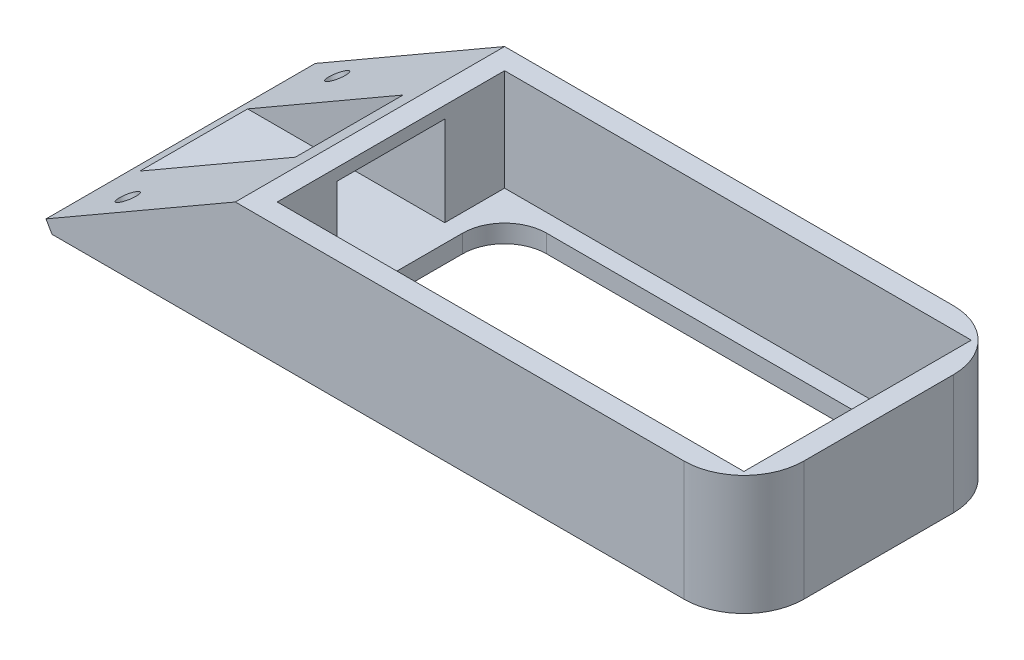
ISO-10303-21;
HEADER;
FILE_DESCRIPTION(('STEP AP214'),'2;1');
FILE_NAME('part.step','',(''),(''),'','','');
FILE_SCHEMA(('AUTOMOTIVE_DESIGN { 1 0 10303 214 1 1 1 1 }'));
ENDSEC;
DATA;
#1=APPLICATION_CONTEXT('core data for automotive mechanical design processes');
#2=APPLICATION_PROTOCOL_DEFINITION('international standard','automotive_design',2000,#1);
#3=PRODUCT_CONTEXT('',#1,'mechanical');
#4=PRODUCT('Part','Part','',(#3));
#5=PRODUCT_RELATED_PRODUCT_CATEGORY('part','',(#4));
#6=PRODUCT_DEFINITION_FORMATION('','',#4);
#7=PRODUCT_DEFINITION_CONTEXT('part definition',#1,'design');
#8=PRODUCT_DEFINITION('design','',#6,#7);
#9=PRODUCT_DEFINITION_SHAPE('','',#8);
#10=(LENGTH_UNIT() NAMED_UNIT(*) SI_UNIT(.MILLI.,.METRE.));
#11=(NAMED_UNIT(*) PLANE_ANGLE_UNIT() SI_UNIT($,.RADIAN.));
#12=(NAMED_UNIT(*) SI_UNIT($,.STERADIAN.) SOLID_ANGLE_UNIT());
#13=UNCERTAINTY_MEASURE_WITH_UNIT(LENGTH_MEASURE(1.E-05),#10,'distance_accuracy_value','');
#14=(GEOMETRIC_REPRESENTATION_CONTEXT(3) GLOBAL_UNCERTAINTY_ASSIGNED_CONTEXT((#13)) GLOBAL_UNIT_ASSIGNED_CONTEXT((#10,
#11,#12)) REPRESENTATION_CONTEXT('',''));
#15=CARTESIAN_POINT('',(0.,0.,0.));
#16=DIRECTION('',(0.,0.,1.));
#17=DIRECTION('',(1.,0.,0.));
#18=AXIS2_PLACEMENT_3D('',#15,#16,#17);
#19=CARTESIAN_POINT('',(0.,0.,45.));
#20=DIRECTION('',(0.,1.,0.));
#21=DIRECTION('',(0.,0.,1.));
#22=AXIS2_PLACEMENT_3D('',#19,#20,#21);
#23=PLANE('',#22);
#24=DIRECTION('',(1.,0.,0.));
#25=VECTOR('',#24,1.);
#26=CARTESIAN_POINT('',(41.1410161513775,0.,6.49999999999998));
#27=LINE('',#26,#25);
#28=CARTESIAN_POINT('',(48.1410161513775,0.,6.49999999999998));
#29=VERTEX_POINT('',#28);
#30=CARTESIAN_POINT('',(106.141016151377,0.,6.49999999999998));
#31=VERTEX_POINT('',#30);
#32=EDGE_CURVE('E251',#29,#31,#27,.T.);
#33=ORIENTED_EDGE('',*,*,#32,.F.);
#34=CARTESIAN_POINT('',(48.1410161513775,0.,13.5));
#35=DIRECTION('',(0.,1.,0.));
#36=DIRECTION('',(0.,0.,1.));
#37=AXIS2_PLACEMENT_3D('',#34,#35,#36);
#38=CIRCLE('',#37,7.);
#39=CARTESIAN_POINT('',(41.1410161513775,0.,13.5));
#40=VERTEX_POINT('',#39);
#41=EDGE_CURVE('E426',#29,#40,#38,.T.);
#42=ORIENTED_EDGE('',*,*,#41,.T.);
#43=DIRECTION('',(0.,0.,-1.));
#44=VECTOR('',#43,1.);
#45=CARTESIAN_POINT('',(41.1410161513775,0.,38.5));
#46=LINE('',#45,#44);
#47=CARTESIAN_POINT('',(41.1410161513775,0.,31.5));
#48=VERTEX_POINT('',#47);
#49=EDGE_CURVE('E255',#48,#40,#46,.T.);
#50=ORIENTED_EDGE('',*,*,#49,.F.);
#51=CARTESIAN_POINT('',(48.1410161513775,0.,31.5));
#52=DIRECTION('',(0.,1.,0.));
#53=DIRECTION('',(0.,0.,1.));
#54=AXIS2_PLACEMENT_3D('',#51,#52,#53);
#55=CIRCLE('',#54,7.);
#56=CARTESIAN_POINT('',(48.1410161513775,0.,38.5));
#57=VERTEX_POINT('',#56);
#58=EDGE_CURVE('E432',#48,#57,#55,.T.);
#59=ORIENTED_EDGE('',*,*,#58,.T.);
#60=DIRECTION('',(-1.,0.,0.));
#61=VECTOR('',#60,1.);
#62=CARTESIAN_POINT('',(41.1410161513775,0.,38.5));
#63=LINE('',#62,#61);
#64=CARTESIAN_POINT('',(106.141016151377,0.,38.5));
#65=VERTEX_POINT('',#64);
#66=EDGE_CURVE('E275',#65,#57,#63,.T.);
#67=ORIENTED_EDGE('',*,*,#66,.F.);
#68=CARTESIAN_POINT('',(106.141016151377,0.,31.5));
#69=DIRECTION('',(0.,1.,0.));
#70=DIRECTION('',(0.,0.,1.));
#71=AXIS2_PLACEMENT_3D('',#68,#69,#70);
#72=CIRCLE('',#71,7.);
#73=CARTESIAN_POINT('',(113.141016151377,0.,31.5));
#74=VERTEX_POINT('',#73);
#75=EDGE_CURVE('E12',#65,#74,#72,.T.);
#76=ORIENTED_EDGE('',*,*,#75,.T.);
#77=DIRECTION('',(0.,0.,1.));
#78=VECTOR('',#77,1.);
#79=CARTESIAN_POINT('',(113.141016151377,0.,38.5));
#80=LINE('',#79,#78);
#81=CARTESIAN_POINT('',(113.141016151377,0.,13.5));
#82=VERTEX_POINT('',#81);
#83=EDGE_CURVE('E212',#82,#74,#80,.T.);
#84=ORIENTED_EDGE('',*,*,#83,.F.);
#85=CARTESIAN_POINT('',(106.141016151377,0.,13.5));
#86=DIRECTION('',(0.,1.,0.));
#87=DIRECTION('',(0.,0.,1.));
#88=AXIS2_PLACEMENT_3D('',#85,#86,#87);
#89=CIRCLE('',#88,7.);
#90=EDGE_CURVE('E438',#82,#31,#89,.T.);
#91=ORIENTED_EDGE('',*,*,#90,.T.);
#92=EDGE_LOOP('',(#33,#42,#50,#59,#67,#76,#84,#91));
#93=FACE_BOUND('',#92,.T.);
#94=DIRECTION('',(1.,0.,0.));
#95=VECTOR('',#94,1.);
#96=CARTESIAN_POINT('',(0.,0.,0.));
#97=LINE('',#96,#95);
#98=CARTESIAN_POINT('',(3.99999999999999,0.,0.));
#99=VERTEX_POINT('',#98);
#100=CARTESIAN_POINT('',(109.641016151377,0.,0.));
#101=VERTEX_POINT('',#100);
#102=EDGE_CURVE('E320',#99,#101,#97,.T.);
#103=ORIENTED_EDGE('',*,*,#102,.T.);
#104=CARTESIAN_POINT('',(109.641016151377,0.,10.));
#105=DIRECTION('',(0.,1.,0.));
#106=DIRECTION('',(0.,0.,1.));
#107=AXIS2_PLACEMENT_3D('',#104,#105,#106);
#108=CIRCLE('',#107,10.);
#109=CARTESIAN_POINT('',(119.641016151377,0.,10.));
#110=VERTEX_POINT('',#109);
#111=EDGE_CURVE('E388',#101,#110,#108,.F.);
#112=ORIENTED_EDGE('',*,*,#111,.T.);
#113=DIRECTION('',(0.,0.,-1.));
#114=VECTOR('',#113,1.);
#115=CARTESIAN_POINT('',(119.641016151377,0.,45.));
#116=LINE('',#115,#114);
#117=CARTESIAN_POINT('',(119.641016151377,0.,35.));
#118=VERTEX_POINT('',#117);
#119=EDGE_CURVE('E365',#118,#110,#116,.T.);
#120=ORIENTED_EDGE('',*,*,#119,.F.);
#121=CARTESIAN_POINT('',(109.641016151377,0.,35.));
#122=DIRECTION('',(0.,1.,0.));
#123=DIRECTION('',(0.,0.,1.));
#124=AXIS2_PLACEMENT_3D('',#121,#122,#123);
#125=CIRCLE('',#124,10.);
#126=CARTESIAN_POINT('',(109.641016151377,0.,45.));
#127=VERTEX_POINT('',#126);
#128=EDGE_CURVE('E385',#118,#127,#125,.F.);
#129=ORIENTED_EDGE('',*,*,#128,.T.);
#130=DIRECTION('',(1.,0.,0.));
#131=VECTOR('',#130,1.);
#132=CARTESIAN_POINT('',(0.,0.,45.));
#133=LINE('',#132,#131);
#134=CARTESIAN_POINT('',(3.99999999999999,0.,45.));
#135=VERTEX_POINT('',#134);
#136=EDGE_CURVE('E321',#135,#127,#133,.T.);
#137=ORIENTED_EDGE('',*,*,#136,.F.);
#138=DIRECTION('',(0.,0.,-1.));
#139=VECTOR('',#138,1.);
#140=CARTESIAN_POINT('',(3.99999999999999,0.,45.));
#141=LINE('',#140,#139);
#142=EDGE_CURVE('E338',#135,#99,#141,.T.);
#143=ORIENTED_EDGE('',*,*,#142,.T.);
#144=EDGE_LOOP('',(#103,#112,#120,#129,#137,#143));
#145=FACE_BOUND('',#144,.T.);
#146=ADVANCED_FACE('F49',(#93,#145),#23,.F.);
#147=CARTESIAN_POINT('',(119.641016151377,0.,45.));
#148=DIRECTION('',(-1.,0.,0.));
#149=DIRECTION('',(0.,0.,1.));
#150=AXIS2_PLACEMENT_3D('',#147,#148,#149);
#151=PLANE('',#150);
#152=ORIENTED_EDGE('',*,*,#119,.T.);
#153=DIRECTION('',(0.,1.,0.));
#154=VECTOR('',#153,1.);
#155=CARTESIAN_POINT('',(119.641016151377,0.,10.));
#156=LINE('',#155,#154);
#157=CARTESIAN_POINT('',(119.641016151377,20.,10.));
#158=VERTEX_POINT('',#157);
#159=EDGE_CURVE('E372',#110,#158,#156,.T.);
#160=ORIENTED_EDGE('',*,*,#159,.T.);
#161=DIRECTION('',(0.,0.,-1.));
#162=VECTOR('',#161,1.);
#163=CARTESIAN_POINT('',(119.641016151377,20.,45.));
#164=LINE('',#163,#162);
#165=CARTESIAN_POINT('',(119.641016151377,20.,35.));
#166=VERTEX_POINT('',#165);
#167=EDGE_CURVE('E361',#166,#158,#164,.T.);
#168=ORIENTED_EDGE('',*,*,#167,.F.);
#169=DIRECTION('',(0.,1.,0.));
#170=VECTOR('',#169,1.);
#171=CARTESIAN_POINT('',(119.641016151377,0.,35.));
#172=LINE('',#171,#170);
#173=EDGE_CURVE('E369',#166,#118,#172,.F.);
#174=ORIENTED_EDGE('',*,*,#173,.T.);
#175=EDGE_LOOP('',(#152,#160,#168,#174));
#176=FACE_BOUND('',#175,.T.);
#177=ADVANCED_FACE('F488',(#176),#151,.F.);
#178=CARTESIAN_POINT('',(0.,20.,45.));
#179=DIRECTION('',(0.,1.,0.));
#180=DIRECTION('',(0.,0.,1.));
#181=AXIS2_PLACEMENT_3D('',#178,#179,#180);
#182=PLANE('',#181);
#183=DIRECTION('',(0.,0.,1.));
#184=VECTOR('',#183,1.);
#185=CARTESIAN_POINT('',(38.1410161513774,20.,41.5));
#186=LINE('',#185,#184);
#187=CARTESIAN_POINT('',(38.1410161513774,20.,3.49999999999999));
#188=VERTEX_POINT('',#187);
#189=CARTESIAN_POINT('',(38.1410161513774,20.,41.5));
#190=VERTEX_POINT('',#189);
#191=EDGE_CURVE('E279',#188,#190,#186,.T.);
#192=ORIENTED_EDGE('',*,*,#191,.F.);
#193=DIRECTION('',(-1.,0.,0.));
#194=VECTOR('',#193,1.);
#195=CARTESIAN_POINT('',(38.1410161513774,20.,3.49999999999999));
#196=LINE('',#195,#194);
#197=CARTESIAN_POINT('',(116.141016151377,20.,3.49999999999999));
#198=VERTEX_POINT('',#197);
#199=EDGE_CURVE('E302',#198,#188,#196,.T.);
#200=ORIENTED_EDGE('',*,*,#199,.F.);
#201=DIRECTION('',(0.,0.,-1.));
#202=VECTOR('',#201,1.);
#203=CARTESIAN_POINT('',(116.141016151377,20.,41.5));
#204=LINE('',#203,#202);
#205=CARTESIAN_POINT('',(116.141016151377,20.,41.5));
#206=VERTEX_POINT('',#205);
#207=EDGE_CURVE('E298',#206,#198,#204,.T.);
#208=ORIENTED_EDGE('',*,*,#207,.F.);
#209=DIRECTION('',(1.,0.,0.));
#210=VECTOR('',#209,1.);
#211=CARTESIAN_POINT('',(38.1410161513774,20.,41.5));
#212=LINE('',#211,#210);
#213=EDGE_CURVE('E294',#190,#206,#212,.T.);
#214=ORIENTED_EDGE('',*,*,#213,.F.);
#215=EDGE_LOOP('',(#192,#200,#208,#214));
#216=FACE_BOUND('',#215,.T.);
#217=ORIENTED_EDGE('',*,*,#167,.T.);
#218=CARTESIAN_POINT('',(109.641016151377,20.,10.));
#219=DIRECTION('',(0.,1.,0.));
#220=DIRECTION('',(0.,0.,1.));
#221=AXIS2_PLACEMENT_3D('',#218,#219,#220);
#222=CIRCLE('',#221,10.);
#223=CARTESIAN_POINT('',(109.641016151377,20.,0.));
#224=VERTEX_POINT('',#223);
#225=EDGE_CURVE('E379',#158,#224,#222,.T.);
#226=ORIENTED_EDGE('',*,*,#225,.T.);
#227=DIRECTION('',(1.,0.,0.));
#228=VECTOR('',#227,1.);
#229=CARTESIAN_POINT('',(0.,20.,0.));
#230=LINE('',#229,#228);
#231=CARTESIAN_POINT('',(34.6410161513774,20.,0.));
#232=VERTEX_POINT('',#231);
#233=EDGE_CURVE('E342',#232,#224,#230,.T.);
#234=ORIENTED_EDGE('',*,*,#233,.F.);
#235=DIRECTION('',(0.,0.,-1.));
#236=VECTOR('',#235,1.);
#237=CARTESIAN_POINT('',(34.6410161513774,20.,45.));
#238=LINE('',#237,#236);
#239=CARTESIAN_POINT('',(34.6410161513774,20.,45.));
#240=VERTEX_POINT('',#239);
#241=EDGE_CURVE('E358',#240,#232,#238,.T.);
#242=ORIENTED_EDGE('',*,*,#241,.F.);
#243=DIRECTION('',(1.,0.,0.));
#244=VECTOR('',#243,1.);
#245=CARTESIAN_POINT('',(0.,20.,45.));
#246=LINE('',#245,#244);
#247=CARTESIAN_POINT('',(109.641016151377,20.,45.));
#248=VERTEX_POINT('',#247);
#249=EDGE_CURVE('E325',#240,#248,#246,.T.);
#250=ORIENTED_EDGE('',*,*,#249,.T.);
#251=CARTESIAN_POINT('',(109.641016151377,20.,35.));
#252=DIRECTION('',(0.,1.,0.));
#253=DIRECTION('',(0.,0.,1.));
#254=AXIS2_PLACEMENT_3D('',#251,#252,#253);
#255=CIRCLE('',#254,10.);
#256=EDGE_CURVE('E376',#248,#166,#255,.T.);
#257=ORIENTED_EDGE('',*,*,#256,.T.);
#258=EDGE_LOOP('',(#217,#226,#234,#242,#250,#257));
#259=FACE_BOUND('',#258,.T.);
#260=ADVANCED_FACE('F495',(#216,#259),#182,.T.);
#261=CARTESIAN_POINT('',(0.,0.,45.));
#262=DIRECTION('',(-0.500000000000001,0.866025403784438,0.));
#263=DIRECTION('',(-0.866025403784438,-0.500000000000001,0.));
#264=AXIS2_PLACEMENT_3D('',#261,#262,#263);
#265=PLANE('',#264);
#266=CARTESIAN_POINT('',(11.6602540378444,6.73205080756889,5.));
#267=DIRECTION('',(-0.500000000000002,0.866025403784438,0.));
#268=DIRECTION('',(-0.866025403784438,-0.500000000000002,0.));
#269=AXIS2_PLACEMENT_3D('',#266,#267,#268);
#270=CIRCLE('',#269,1.6);
#271=CARTESIAN_POINT('',(10.2746133917893,5.93205080756888,5.));
#272=VERTEX_POINT('',#271);
#273=EDGE_CURVE('E602',#272,#272,#270,.T.);
#274=ORIENTED_EDGE('',*,*,#273,.F.);
#275=EDGE_LOOP('',(#274));
#276=FACE_BOUND('',#275,.T.);
#277=CARTESIAN_POINT('',(11.6602540378444,6.73205080756889,40.));
#278=DIRECTION('',(-0.500000000000002,0.866025403784438,0.));
#279=DIRECTION('',(-0.866025403784438,-0.500000000000002,0.));
#280=AXIS2_PLACEMENT_3D('',#277,#278,#279);
#281=CIRCLE('',#280,1.6);
#282=CARTESIAN_POINT('',(10.2746133917893,5.93205080756889,40.));
#283=VERTEX_POINT('',#282);
#284=EDGE_CURVE('E607',#283,#283,#281,.T.);
#285=ORIENTED_EDGE('',*,*,#284,.F.);
#286=EDGE_LOOP('',(#285));
#287=FACE_BOUND('',#286,.T.);
#288=DIRECTION('',(-0.866025403784438,-0.500000000000001,0.));
#289=VECTOR('',#288,1.);
#290=CARTESIAN_POINT('',(3.54828810567664,2.04860509297476,31.5));
#291=LINE('',#290,#289);
#292=CARTESIAN_POINT('',(31.1769145362397,18.,31.5));
#293=VERTEX_POINT('',#292);
#294=CARTESIAN_POINT('',(5.19615242270662,3.,31.5));
#295=VERTEX_POINT('',#294);
#296=EDGE_CURVE('E216',#293,#295,#291,.T.);
#297=ORIENTED_EDGE('',*,*,#296,.T.);
#298=DIRECTION('',(0.,0.,-1.));
#299=VECTOR('',#298,1.);
#300=CARTESIAN_POINT('',(5.19615242270662,3.,31.5));
#301=LINE('',#300,#299);
#302=CARTESIAN_POINT('',(5.19615242270662,3.,13.5));
#303=VERTEX_POINT('',#302);
#304=EDGE_CURVE('E203',#295,#303,#301,.T.);
#305=ORIENTED_EDGE('',*,*,#304,.T.);
#306=DIRECTION('',(0.866025403784438,0.500000000000001,0.));
#307=VECTOR('',#306,1.);
#308=CARTESIAN_POINT('',(3.54828810567664,2.04860509297476,13.5));
#309=LINE('',#308,#307);
#310=CARTESIAN_POINT('',(31.1769145362397,18.,13.5));
#311=VERTEX_POINT('',#310);
#312=EDGE_CURVE('E231',#303,#311,#309,.T.);
#313=ORIENTED_EDGE('',*,*,#312,.T.);
#314=DIRECTION('',(0.,0.,1.));
#315=VECTOR('',#314,1.);
#316=CARTESIAN_POINT('',(31.1769145362397,18.,31.5));
#317=LINE('',#316,#315);
#318=EDGE_CURVE('E224',#311,#293,#317,.T.);
#319=ORIENTED_EDGE('',*,*,#318,.T.);
#320=EDGE_LOOP('',(#297,#305,#313,#319));
#321=FACE_BOUND('',#320,.T.);
#322=DIRECTION('',(0.866025403784438,0.500000000000001,0.));
#323=VECTOR('',#322,1.);
#324=CARTESIAN_POINT('',(0.,0.,0.));
#325=LINE('',#324,#323);
#326=CARTESIAN_POINT('',(2.99999999999998,1.73205080756887,0.));
#327=VERTEX_POINT('',#326);
#328=EDGE_CURVE('E346',#327,#232,#325,.T.);
#329=ORIENTED_EDGE('',*,*,#328,.F.);
#330=DIRECTION('',(0.,0.,-1.));
#331=VECTOR('',#330,1.);
#332=CARTESIAN_POINT('',(2.99999999999998,1.73205080756887,45.));
#333=LINE('',#332,#331);
#334=CARTESIAN_POINT('',(2.99999999999998,1.73205080756887,45.));
#335=VERTEX_POINT('',#334);
#336=EDGE_CURVE('E355',#335,#327,#333,.T.);
#337=ORIENTED_EDGE('',*,*,#336,.F.);
#338=DIRECTION('',(0.866025403784438,0.500000000000001,0.));
#339=VECTOR('',#338,1.);
#340=CARTESIAN_POINT('',(0.,0.,45.));
#341=LINE('',#340,#339);
#342=EDGE_CURVE('E330',#335,#240,#341,.T.);
#343=ORIENTED_EDGE('',*,*,#342,.T.);
#344=ORIENTED_EDGE('',*,*,#241,.T.);
#345=EDGE_LOOP('',(#329,#337,#343,#344));
#346=FACE_BOUND('',#345,.T.);
#347=ADVANCED_FACE('F222',(#276,#287,#321,#346),#265,.T.);
#348=CARTESIAN_POINT('',(2.99999999999998,1.73205080756888,45.));
#349=DIRECTION('',(-0.866025403784436,-0.500000000000004,0.));
#350=DIRECTION('',(0.500000000000004,-0.866025403784436,0.));
#351=AXIS2_PLACEMENT_3D('',#348,#349,#350);
#352=PLANE('',#351);
#353=DIRECTION('',(-0.500000000000004,0.866025403784436,0.));
#354=VECTOR('',#353,1.);
#355=CARTESIAN_POINT('',(2.99999999999998,1.73205080756888,0.));
#356=LINE('',#355,#354);
#357=EDGE_CURVE('E326',#99,#327,#356,.T.);
#358=ORIENTED_EDGE('',*,*,#357,.F.);
#359=ORIENTED_EDGE('',*,*,#142,.F.);
#360=DIRECTION('',(-0.500000000000004,0.866025403784436,0.));
#361=VECTOR('',#360,1.);
#362=CARTESIAN_POINT('',(2.99999999999998,1.73205080756888,45.));
#363=LINE('',#362,#361);
#364=EDGE_CURVE('E334',#135,#335,#363,.T.);
#365=ORIENTED_EDGE('',*,*,#364,.T.);
#366=ORIENTED_EDGE('',*,*,#336,.T.);
#367=EDGE_LOOP('',(#358,#359,#365,#366));
#368=FACE_BOUND('',#367,.T.);
#369=ADVANCED_FACE('F519',(#368),#352,.T.);
#370=CARTESIAN_POINT('',(0.,0.,45.));
#371=DIRECTION('',(0.,0.,1.));
#372=DIRECTION('',(1.,0.,0.));
#373=AXIS2_PLACEMENT_3D('',#370,#371,#372);
#374=PLANE('',#373);
#375=ORIENTED_EDGE('',*,*,#136,.T.);
#376=DIRECTION('',(0.,1.,0.));
#377=VECTOR('',#376,1.);
#378=CARTESIAN_POINT('',(109.641016151377,20.,45.));
#379=LINE('',#378,#377);
#380=EDGE_CURVE('E391',#127,#248,#379,.T.);
#381=ORIENTED_EDGE('',*,*,#380,.T.);
#382=ORIENTED_EDGE('',*,*,#249,.F.);
#383=ORIENTED_EDGE('',*,*,#342,.F.);
#384=ORIENTED_EDGE('',*,*,#364,.F.);
#385=EDGE_LOOP('',(#375,#381,#382,#383,#384));
#386=FACE_BOUND('',#385,.T.);
#387=ADVANCED_FACE('F514',(#386),#374,.T.);
#388=CARTESIAN_POINT('',(0.,0.,0.));
#389=DIRECTION('',(0.,0.,1.));
#390=DIRECTION('',(1.,0.,0.));
#391=AXIS2_PLACEMENT_3D('',#388,#389,#390);
#392=PLANE('',#391);
#393=ORIENTED_EDGE('',*,*,#233,.T.);
#394=DIRECTION('',(0.,1.,0.));
#395=VECTOR('',#394,1.);
#396=CARTESIAN_POINT('',(109.641016151377,0.,0.));
#397=LINE('',#396,#395);
#398=EDGE_CURVE('E382',#224,#101,#397,.F.);
#399=ORIENTED_EDGE('',*,*,#398,.T.);
#400=ORIENTED_EDGE('',*,*,#102,.F.);
#401=ORIENTED_EDGE('',*,*,#357,.T.);
#402=ORIENTED_EDGE('',*,*,#328,.T.);
#403=EDGE_LOOP('',(#393,#399,#400,#401,#402));
#404=FACE_BOUND('',#403,.T.);
#405=ADVANCED_FACE('F524',(#404),#392,.F.);
#406=CARTESIAN_POINT('',(38.1410161513774,-86.7640478539355,41.5));
#407=DIRECTION('',(-1.,0.,0.));
#408=DIRECTION('',(0.,0.,1.));
#409=AXIS2_PLACEMENT_3D('',#406,#407,#408);
#410=PLANE('',#409);
#411=DIRECTION('',(0.,0.,-1.));
#412=VECTOR('',#411,1.);
#413=CARTESIAN_POINT('',(38.1410161513774,3.,41.5));
#414=LINE('',#413,#412);
#415=CARTESIAN_POINT('',(38.1410161513774,3.,41.5));
#416=VERTEX_POINT('',#415);
#417=CARTESIAN_POINT('',(38.1410161513774,3.,31.5));
#418=VERTEX_POINT('',#417);
#419=EDGE_CURVE('E288',#416,#418,#414,.T.);
#420=ORIENTED_EDGE('',*,*,#419,.T.);
#421=DIRECTION('',(0.,-1.,0.));
#422=VECTOR('',#421,1.);
#423=CARTESIAN_POINT('',(38.1410161513774,3.,31.5));
#424=LINE('',#423,#422);
#425=CARTESIAN_POINT('',(38.1410161513774,18.,31.5));
#426=VERTEX_POINT('',#425);
#427=EDGE_CURVE('E73',#426,#418,#424,.T.);
#428=ORIENTED_EDGE('',*,*,#427,.F.);
#429=DIRECTION('',(0.,0.,1.));
#430=VECTOR('',#429,1.);
#431=CARTESIAN_POINT('',(38.1410161513774,18.,31.5));
#432=LINE('',#431,#430);
#433=CARTESIAN_POINT('',(38.1410161513774,18.,13.5));
#434=VERTEX_POINT('',#433);
#435=EDGE_CURVE('E219',#434,#426,#432,.T.);
#436=ORIENTED_EDGE('',*,*,#435,.F.);
#437=DIRECTION('',(0.,1.,0.));
#438=VECTOR('',#437,1.);
#439=CARTESIAN_POINT('',(38.1410161513774,3.,13.5));
#440=LINE('',#439,#438);
#441=CARTESIAN_POINT('',(38.1410161513774,3.,13.5));
#442=VERTEX_POINT('',#441);
#443=EDGE_CURVE('E229',#442,#434,#440,.T.);
#444=ORIENTED_EDGE('',*,*,#443,.F.);
#445=CARTESIAN_POINT('',(38.1410161513774,3.,3.49999999999999));
#446=VERTEX_POINT('',#445);
#447=EDGE_CURVE('E287',#442,#446,#414,.T.);
#448=ORIENTED_EDGE('',*,*,#447,.T.);
#449=DIRECTION('',(0.,1.,0.));
#450=VECTOR('',#449,1.);
#451=CARTESIAN_POINT('',(38.1410161513774,-86.7640478539355,3.49999999999999));
#452=LINE('',#451,#450);
#453=EDGE_CURVE('E284',#446,#188,#452,.T.);
#454=ORIENTED_EDGE('',*,*,#453,.T.);
#455=ORIENTED_EDGE('',*,*,#191,.T.);
#456=DIRECTION('',(0.,1.,0.));
#457=VECTOR('',#456,1.);
#458=CARTESIAN_POINT('',(38.1410161513774,-86.7640478539355,41.5));
#459=LINE('',#458,#457);
#460=EDGE_CURVE('E306',#416,#190,#459,.T.);
#461=ORIENTED_EDGE('',*,*,#460,.F.);
#462=EDGE_LOOP('',(#420,#428,#436,#444,#448,#454,#455,#461));
#463=FACE_BOUND('',#462,.T.);
#464=ADVANCED_FACE('F546',(#463),#410,.F.);
#465=CARTESIAN_POINT('',(38.1410161513774,-86.7640478539355,3.49999999999999));
#466=DIRECTION('',(0.,0.,-1.));
#467=DIRECTION('',(-1.,0.,0.));
#468=AXIS2_PLACEMENT_3D('',#465,#466,#467);
#469=PLANE('',#468);
#470=DIRECTION('',(1.,0.,0.));
#471=VECTOR('',#470,1.);
#472=CARTESIAN_POINT('',(38.1410161513774,3.,3.49999999999999));
#473=LINE('',#472,#471);
#474=CARTESIAN_POINT('',(116.141016151377,3.,3.49999999999999));
#475=VERTEX_POINT('',#474);
#476=EDGE_CURVE('E283',#446,#475,#473,.T.);
#477=ORIENTED_EDGE('',*,*,#476,.T.);
#478=DIRECTION('',(0.,1.,0.));
#479=VECTOR('',#478,1.);
#480=CARTESIAN_POINT('',(116.141016151377,-86.7640478539355,3.49999999999999));
#481=LINE('',#480,#479);
#482=EDGE_CURVE('E309',#475,#198,#481,.T.);
#483=ORIENTED_EDGE('',*,*,#482,.T.);
#484=ORIENTED_EDGE('',*,*,#199,.T.);
#485=ORIENTED_EDGE('',*,*,#453,.F.);
#486=EDGE_LOOP('',(#477,#483,#484,#485));
#487=FACE_BOUND('',#486,.T.);
#488=ADVANCED_FACE('F551',(#487),#469,.F.);
#489=CARTESIAN_POINT('',(116.141016151377,-86.7640478539355,41.5));
#490=DIRECTION('',(1.,0.,0.));
#491=DIRECTION('',(0.,0.,-1.));
#492=AXIS2_PLACEMENT_3D('',#489,#490,#491);
#493=PLANE('',#492);
#494=DIRECTION('',(0.,0.,1.));
#495=VECTOR('',#494,1.);
#496=CARTESIAN_POINT('',(116.141016151377,3.,41.5));
#497=LINE('',#496,#495);
#498=CARTESIAN_POINT('',(116.141016151377,3.,41.5));
#499=VERTEX_POINT('',#498);
#500=EDGE_CURVE('E280',#475,#499,#497,.T.);
#501=ORIENTED_EDGE('',*,*,#500,.T.);
#502=DIRECTION('',(0.,1.,0.));
#503=VECTOR('',#502,1.);
#504=CARTESIAN_POINT('',(116.141016151377,-86.7640478539355,41.5));
#505=LINE('',#504,#503);
#506=EDGE_CURVE('E312',#499,#206,#505,.T.);
#507=ORIENTED_EDGE('',*,*,#506,.T.);
#508=ORIENTED_EDGE('',*,*,#207,.T.);
#509=ORIENTED_EDGE('',*,*,#482,.F.);
#510=EDGE_LOOP('',(#501,#507,#508,#509));
#511=FACE_BOUND('',#510,.T.);
#512=ADVANCED_FACE('F556',(#511),#493,.F.);
#513=CARTESIAN_POINT('',(38.1410161513774,-86.7640478539355,41.5));
#514=DIRECTION('',(0.,0.,1.));
#515=DIRECTION('',(1.,0.,0.));
#516=AXIS2_PLACEMENT_3D('',#513,#514,#515);
#517=PLANE('',#516);
#518=DIRECTION('',(-1.,0.,0.));
#519=VECTOR('',#518,1.);
#520=CARTESIAN_POINT('',(38.1410161513774,3.,41.5));
#521=LINE('',#520,#519);
#522=EDGE_CURVE('E291',#499,#416,#521,.T.);
#523=ORIENTED_EDGE('',*,*,#522,.T.);
#524=ORIENTED_EDGE('',*,*,#460,.T.);
#525=ORIENTED_EDGE('',*,*,#213,.T.);
#526=ORIENTED_EDGE('',*,*,#506,.F.);
#527=EDGE_LOOP('',(#523,#524,#525,#526));
#528=FACE_BOUND('',#527,.T.);
#529=ADVANCED_FACE('F553',(#528),#517,.F.);
#530=CARTESIAN_POINT('',(0.,3.,45.));
#531=DIRECTION('',(0.,1.,0.));
#532=DIRECTION('',(0.,0.,1.));
#533=AXIS2_PLACEMENT_3D('',#530,#531,#532);
#534=PLANE('',#533);
#535=DIRECTION('',(0.,0.,1.));
#536=VECTOR('',#535,1.);
#537=CARTESIAN_POINT('',(41.1410161513775,3.,38.5));
#538=LINE('',#537,#536);
#539=CARTESIAN_POINT('',(41.1410161513775,3.,13.5));
#540=VERTEX_POINT('',#539);
#541=CARTESIAN_POINT('',(41.1410161513775,3.,31.5));
#542=VERTEX_POINT('',#541);
#543=EDGE_CURVE('E259',#540,#542,#538,.T.);
#544=ORIENTED_EDGE('',*,*,#543,.F.);
#545=CARTESIAN_POINT('',(48.1410161513775,3.,13.5));
#546=DIRECTION('',(0.,1.,0.));
#547=DIRECTION('',(0.,0.,1.));
#548=AXIS2_PLACEMENT_3D('',#545,#546,#547);
#549=CIRCLE('',#548,7.);
#550=CARTESIAN_POINT('',(48.1410161513775,3.,6.49999999999998));
#551=VERTEX_POINT('',#550);
#552=EDGE_CURVE('E423',#540,#551,#549,.F.);
#553=ORIENTED_EDGE('',*,*,#552,.T.);
#554=DIRECTION('',(-1.,0.,0.));
#555=VECTOR('',#554,1.);
#556=CARTESIAN_POINT('',(41.1410161513775,3.,6.49999999999998));
#557=LINE('',#556,#555);
#558=CARTESIAN_POINT('',(106.141016151377,3.,6.49999999999998));
#559=VERTEX_POINT('',#558);
#560=EDGE_CURVE('E271',#559,#551,#557,.T.);
#561=ORIENTED_EDGE('',*,*,#560,.F.);
#562=CARTESIAN_POINT('',(106.141016151377,3.,13.5));
#563=DIRECTION('',(0.,1.,0.));
#564=DIRECTION('',(0.,0.,1.));
#565=AXIS2_PLACEMENT_3D('',#562,#563,#564);
#566=CIRCLE('',#565,7.);
#567=CARTESIAN_POINT('',(113.141016151377,3.,13.5));
#568=VERTEX_POINT('',#567);
#569=EDGE_CURVE('E435',#559,#568,#566,.F.);
#570=ORIENTED_EDGE('',*,*,#569,.T.);
#571=DIRECTION('',(0.,0.,-1.));
#572=VECTOR('',#571,1.);
#573=CARTESIAN_POINT('',(113.141016151377,3.,38.5));
#574=LINE('',#573,#572);
#575=CARTESIAN_POINT('',(113.141016151377,3.,31.5));
#576=VERTEX_POINT('',#575);
#577=EDGE_CURVE('E267',#576,#568,#574,.T.);
#578=ORIENTED_EDGE('',*,*,#577,.F.);
#579=CARTESIAN_POINT('',(106.141016151377,3.,31.5));
#580=DIRECTION('',(0.,1.,0.));
#581=DIRECTION('',(0.,0.,1.));
#582=AXIS2_PLACEMENT_3D('',#579,#580,#581);
#583=CIRCLE('',#582,7.);
#584=CARTESIAN_POINT('',(106.141016151377,3.,38.5));
#585=VERTEX_POINT('',#584);
#586=EDGE_CURVE('E58',#576,#585,#583,.F.);
#587=ORIENTED_EDGE('',*,*,#586,.T.);
#588=DIRECTION('',(1.,0.,0.));
#589=VECTOR('',#588,1.);
#590=CARTESIAN_POINT('',(41.1410161513775,3.,38.5));
#591=LINE('',#590,#589);
#592=CARTESIAN_POINT('',(48.1410161513775,3.,38.5));
#593=VERTEX_POINT('',#592);
#594=EDGE_CURVE('E263',#593,#585,#591,.T.);
#595=ORIENTED_EDGE('',*,*,#594,.F.);
#596=CARTESIAN_POINT('',(48.1410161513775,3.,31.5));
#597=DIRECTION('',(0.,1.,0.));
#598=DIRECTION('',(0.,0.,1.));
#599=AXIS2_PLACEMENT_3D('',#596,#597,#598);
#600=CIRCLE('',#599,7.);
#601=EDGE_CURVE('E429',#593,#542,#600,.F.);
#602=ORIENTED_EDGE('',*,*,#601,.T.);
#603=EDGE_LOOP('',(#544,#553,#561,#570,#578,#587,#595,#602));
#604=FACE_BOUND('',#603,.T.);
#605=ORIENTED_EDGE('',*,*,#419,.F.);
#606=ORIENTED_EDGE('',*,*,#522,.F.);
#607=ORIENTED_EDGE('',*,*,#500,.F.);
#608=ORIENTED_EDGE('',*,*,#476,.F.);
#609=ORIENTED_EDGE('',*,*,#447,.F.);
#610=DIRECTION('',(1.,0.,0.));
#611=VECTOR('',#610,1.);
#612=CARTESIAN_POINT('',(2.99899999999998,3.,13.5));
#613=LINE('',#612,#611);
#614=EDGE_CURVE('E65',#303,#442,#613,.T.);
#615=ORIENTED_EDGE('',*,*,#614,.F.);
#616=ORIENTED_EDGE('',*,*,#304,.F.);
#617=DIRECTION('',(1.,0.,0.));
#618=VECTOR('',#617,1.);
#619=CARTESIAN_POINT('',(2.99899999999998,3.,31.5));
#620=LINE('',#619,#618);
#621=EDGE_CURVE('E206',#295,#418,#620,.T.);
#622=ORIENTED_EDGE('',*,*,#621,.T.);
#623=EDGE_LOOP('',(#605,#606,#607,#608,#609,#615,#616,#622));
#624=FACE_BOUND('',#623,.T.);
#625=ADVANCED_FACE('F205',(#604,#624),#534,.T.);
#626=CARTESIAN_POINT('',(41.1410161513775,-0.00100000000000013,38.5));
#627=DIRECTION('',(-1.,0.,0.));
#628=DIRECTION('',(0.,0.,1.));
#629=AXIS2_PLACEMENT_3D('',#626,#627,#628);
#630=PLANE('',#629);
#631=ORIENTED_EDGE('',*,*,#49,.T.);
#632=DIRECTION('',(0.,1.,0.));
#633=VECTOR('',#632,1.);
#634=CARTESIAN_POINT('',(41.1410161513775,3.,13.5));
#635=LINE('',#634,#633);
#636=EDGE_CURVE('E398',#40,#540,#635,.T.);
#637=ORIENTED_EDGE('',*,*,#636,.T.);
#638=ORIENTED_EDGE('',*,*,#543,.T.);
#639=DIRECTION('',(0.,1.,0.));
#640=VECTOR('',#639,1.);
#641=CARTESIAN_POINT('',(41.1410161513775,0.,31.5));
#642=LINE('',#641,#640);
#643=EDGE_CURVE('E395',#542,#48,#642,.F.);
#644=ORIENTED_EDGE('',*,*,#643,.T.);
#645=EDGE_LOOP('',(#631,#637,#638,#644));
#646=FACE_BOUND('',#645,.T.);
#647=ADVANCED_FACE('F475',(#646),#630,.F.);
#648=CARTESIAN_POINT('',(41.1410161513775,-0.00100000000000013,6.49999999999998));
#649=DIRECTION('',(0.,0.,-1.));
#650=DIRECTION('',(-1.,0.,0.));
#651=AXIS2_PLACEMENT_3D('',#648,#649,#650);
#652=PLANE('',#651);
#653=ORIENTED_EDGE('',*,*,#560,.T.);
#654=DIRECTION('',(0.,1.,0.));
#655=VECTOR('',#654,1.);
#656=CARTESIAN_POINT('',(48.1410161513775,0.,6.49999999999998));
#657=LINE('',#656,#655);
#658=EDGE_CURVE('E406',#551,#29,#657,.F.);
#659=ORIENTED_EDGE('',*,*,#658,.T.);
#660=ORIENTED_EDGE('',*,*,#32,.T.);
#661=DIRECTION('',(0.,1.,0.));
#662=VECTOR('',#661,1.);
#663=CARTESIAN_POINT('',(106.141016151377,3.,6.49999999999998));
#664=LINE('',#663,#662);
#665=EDGE_CURVE('E402',#31,#559,#664,.T.);
#666=ORIENTED_EDGE('',*,*,#665,.T.);
#667=EDGE_LOOP('',(#653,#659,#660,#666));
#668=FACE_BOUND('',#667,.T.);
#669=ADVANCED_FACE('F466',(#668),#652,.F.);
#670=CARTESIAN_POINT('',(113.141016151377,-0.00100000000000013,38.5));
#671=DIRECTION('',(1.,0.,0.));
#672=DIRECTION('',(0.,0.,-1.));
#673=AXIS2_PLACEMENT_3D('',#670,#671,#672);
#674=PLANE('',#673);
#675=ORIENTED_EDGE('',*,*,#577,.T.);
#676=DIRECTION('',(0.,1.,0.));
#677=VECTOR('',#676,1.);
#678=CARTESIAN_POINT('',(113.141016151377,0.,13.5));
#679=LINE('',#678,#677);
#680=EDGE_CURVE('E420',#568,#82,#679,.F.);
#681=ORIENTED_EDGE('',*,*,#680,.T.);
#682=ORIENTED_EDGE('',*,*,#83,.T.);
#683=DIRECTION('',(0.,1.,0.));
#684=VECTOR('',#683,1.);
#685=CARTESIAN_POINT('',(113.141016151377,3.,31.5));
#686=LINE('',#685,#684);
#687=EDGE_CURVE('E416',#74,#576,#686,.T.);
#688=ORIENTED_EDGE('',*,*,#687,.T.);
#689=EDGE_LOOP('',(#675,#681,#682,#688));
#690=FACE_BOUND('',#689,.T.);
#691=ADVANCED_FACE('F459',(#690),#674,.F.);
#692=CARTESIAN_POINT('',(41.1410161513775,-0.00100000000000013,38.5));
#693=DIRECTION('',(0.,0.,1.));
#694=DIRECTION('',(1.,0.,0.));
#695=AXIS2_PLACEMENT_3D('',#692,#693,#694);
#696=PLANE('',#695);
#697=ORIENTED_EDGE('',*,*,#66,.T.);
#698=DIRECTION('',(0.,1.,0.));
#699=VECTOR('',#698,1.);
#700=CARTESIAN_POINT('',(48.1410161513775,3.,38.5));
#701=LINE('',#700,#699);
#702=EDGE_CURVE('E412',#57,#593,#701,.T.);
#703=ORIENTED_EDGE('',*,*,#702,.T.);
#704=ORIENTED_EDGE('',*,*,#594,.T.);
#705=DIRECTION('',(0.,1.,0.));
#706=VECTOR('',#705,1.);
#707=CARTESIAN_POINT('',(106.141016151377,0.,38.5));
#708=LINE('',#707,#706);
#709=EDGE_CURVE('E409',#585,#65,#708,.F.);
#710=ORIENTED_EDGE('',*,*,#709,.T.);
#711=EDGE_LOOP('',(#697,#703,#704,#710));
#712=FACE_BOUND('',#711,.T.);
#713=ADVANCED_FACE('F449',(#712),#696,.F.);
#714=CARTESIAN_POINT('',(109.641016151377,0.,10.));
#715=DIRECTION('',(0.,1.,0.));
#716=DIRECTION('',(0.,0.,1.));
#717=AXIS2_PLACEMENT_3D('',#714,#715,#716);
#718=CYLINDRICAL_SURFACE('',#717,10.);
#719=ORIENTED_EDGE('',*,*,#111,.F.);
#720=ORIENTED_EDGE('',*,*,#398,.F.);
#721=ORIENTED_EDGE('',*,*,#225,.F.);
#722=ORIENTED_EDGE('',*,*,#159,.F.);
#723=EDGE_LOOP('',(#719,#720,#721,#722));
#724=FACE_BOUND('',#723,.T.);
#725=ADVANCED_FACE('F500',(#724),#718,.T.);
#726=CARTESIAN_POINT('',(109.641016151377,0.,35.));
#727=DIRECTION('',(0.,-1.,0.));
#728=DIRECTION('',(0.,0.,-1.));
#729=AXIS2_PLACEMENT_3D('',#726,#727,#728);
#730=CYLINDRICAL_SURFACE('',#729,10.);
#731=ORIENTED_EDGE('',*,*,#128,.F.);
#732=ORIENTED_EDGE('',*,*,#173,.F.);
#733=ORIENTED_EDGE('',*,*,#256,.F.);
#734=ORIENTED_EDGE('',*,*,#380,.F.);
#735=EDGE_LOOP('',(#731,#732,#733,#734));
#736=FACE_BOUND('',#735,.T.);
#737=ADVANCED_FACE('F485',(#736),#730,.T.);
#738=CARTESIAN_POINT('',(48.1410161513775,-0.00100000000000013,13.5));
#739=DIRECTION('',(0.,-1.,0.));
#740=DIRECTION('',(0.,0.,-1.));
#741=AXIS2_PLACEMENT_3D('',#738,#739,#740);
#742=CYLINDRICAL_SURFACE('',#741,7.);
#743=ORIENTED_EDGE('',*,*,#41,.F.);
#744=ORIENTED_EDGE('',*,*,#658,.F.);
#745=ORIENTED_EDGE('',*,*,#552,.F.);
#746=ORIENTED_EDGE('',*,*,#636,.F.);
#747=EDGE_LOOP('',(#743,#744,#745,#746));
#748=FACE_BOUND('',#747,.T.);
#749=ADVANCED_FACE('F470',(#748),#742,.F.);
#750=CARTESIAN_POINT('',(48.1410161513775,-0.00100000000000013,31.5));
#751=DIRECTION('',(0.,-1.,0.));
#752=DIRECTION('',(0.,0.,-1.));
#753=AXIS2_PLACEMENT_3D('',#750,#751,#752);
#754=CYLINDRICAL_SURFACE('',#753,7.);
#755=ORIENTED_EDGE('',*,*,#58,.F.);
#756=ORIENTED_EDGE('',*,*,#643,.F.);
#757=ORIENTED_EDGE('',*,*,#601,.F.);
#758=ORIENTED_EDGE('',*,*,#702,.F.);
#759=EDGE_LOOP('',(#755,#756,#757,#758));
#760=FACE_BOUND('',#759,.T.);
#761=ADVANCED_FACE('F478',(#760),#754,.F.);
#762=CARTESIAN_POINT('',(106.141016151377,-0.00100000000000013,13.5));
#763=DIRECTION('',(0.,-1.,0.));
#764=DIRECTION('',(0.,0.,-1.));
#765=AXIS2_PLACEMENT_3D('',#762,#763,#764);
#766=CYLINDRICAL_SURFACE('',#765,7.);
#767=ORIENTED_EDGE('',*,*,#90,.F.);
#768=ORIENTED_EDGE('',*,*,#680,.F.);
#769=ORIENTED_EDGE('',*,*,#569,.F.);
#770=ORIENTED_EDGE('',*,*,#665,.F.);
#771=EDGE_LOOP('',(#767,#768,#769,#770));
#772=FACE_BOUND('',#771,.T.);
#773=ADVANCED_FACE('F462',(#772),#766,.F.);
#774=CARTESIAN_POINT('',(106.141016151377,-0.00100000000000013,31.5));
#775=DIRECTION('',(0.,-1.,0.));
#776=DIRECTION('',(0.,0.,-1.));
#777=AXIS2_PLACEMENT_3D('',#774,#775,#776);
#778=CYLINDRICAL_SURFACE('',#777,7.);
#779=ORIENTED_EDGE('',*,*,#75,.F.);
#780=ORIENTED_EDGE('',*,*,#709,.F.);
#781=ORIENTED_EDGE('',*,*,#586,.F.);
#782=ORIENTED_EDGE('',*,*,#687,.F.);
#783=EDGE_LOOP('',(#779,#780,#781,#782));
#784=FACE_BOUND('',#783,.T.);
#785=ADVANCED_FACE('F51',(#784),#778,.F.);
#786=CARTESIAN_POINT('',(2.99899999999998,3.,31.5));
#787=DIRECTION('',(0.,0.,1.));
#788=DIRECTION('',(1.,0.,0.));
#789=AXIS2_PLACEMENT_3D('',#786,#787,#788);
#790=PLANE('',#789);
#791=DIRECTION('',(1.,0.,0.));
#792=VECTOR('',#791,1.);
#793=CARTESIAN_POINT('',(2.99899999999998,18.,31.5));
#794=LINE('',#793,#792);
#795=EDGE_CURVE('E213',#293,#426,#794,.T.);
#796=ORIENTED_EDGE('',*,*,#795,.T.);
#797=ORIENTED_EDGE('',*,*,#427,.T.);
#798=ORIENTED_EDGE('',*,*,#621,.F.);
#799=ORIENTED_EDGE('',*,*,#296,.F.);
#800=EDGE_LOOP('',(#796,#797,#798,#799));
#801=FACE_BOUND('',#800,.T.);
#802=ADVANCED_FACE('F215',(#801),#790,.F.);
#803=CARTESIAN_POINT('',(2.99899999999998,18.,31.5));
#804=DIRECTION('',(0.,1.,0.));
#805=DIRECTION('',(0.,0.,1.));
#806=AXIS2_PLACEMENT_3D('',#803,#804,#805);
#807=PLANE('',#806);
#808=DIRECTION('',(1.,0.,0.));
#809=VECTOR('',#808,1.);
#810=CARTESIAN_POINT('',(2.99899999999998,18.,13.5));
#811=LINE('',#810,#809);
#812=EDGE_CURVE('E243',#311,#434,#811,.T.);
#813=ORIENTED_EDGE('',*,*,#812,.T.);
#814=ORIENTED_EDGE('',*,*,#435,.T.);
#815=ORIENTED_EDGE('',*,*,#795,.F.);
#816=ORIENTED_EDGE('',*,*,#318,.F.);
#817=EDGE_LOOP('',(#813,#814,#815,#816));
#818=FACE_BOUND('',#817,.T.);
#819=ADVANCED_FACE('F575',(#818),#807,.F.);
#820=CARTESIAN_POINT('',(2.99899999999998,3.,13.5));
#821=DIRECTION('',(0.,0.,-1.));
#822=DIRECTION('',(-1.,0.,0.));
#823=AXIS2_PLACEMENT_3D('',#820,#821,#822);
#824=PLANE('',#823);
#825=ORIENTED_EDGE('',*,*,#614,.T.);
#826=ORIENTED_EDGE('',*,*,#443,.T.);
#827=ORIENTED_EDGE('',*,*,#812,.F.);
#828=ORIENTED_EDGE('',*,*,#312,.F.);
#829=EDGE_LOOP('',(#825,#826,#827,#828));
#830=FACE_BOUND('',#829,.T.);
#831=ADVANCED_FACE('F576',(#830),#824,.F.);
#832=CARTESIAN_POINT('',(17.8300702247961,-3.95438430159237,40.));
#833=DIRECTION('',(-0.500000000000002,0.866025403784438,0.));
#834=DIRECTION('',(-0.866025403784438,-0.500000000000002,0.));
#835=AXIS2_PLACEMENT_3D('',#832,#833,#834);
#836=CYLINDRICAL_SURFACE('',#835,1.6);
#837=CARTESIAN_POINT('',(14.3923048454133,2.,40.));
#838=DIRECTION('',(0.,1.,0.));
#839=DIRECTION('',(-1.,0.,0.));
#840=AXIS2_PLACEMENT_3D('',#837,#838,#839);
#841=ELLIPSE('',#840,1.84752086140681,1.6);
#842=CARTESIAN_POINT('',(12.5447839840064,2.,40.));
#843=VERTEX_POINT('',#842);
#844=EDGE_CURVE('E610',#843,#843,#841,.F.);
#845=ORIENTED_EDGE('',*,*,#844,.T.);
#846=EDGE_LOOP('',(#845));
#847=FACE_BOUND('',#846,.T.);
#848=ORIENTED_EDGE('',*,*,#284,.T.);
#849=EDGE_LOOP('',(#848));
#850=FACE_BOUND('',#849,.T.);
#851=ADVANCED_FACE('F578',(#847,#850),#836,.F.);
#852=CARTESIAN_POINT('',(0.,2.,45.));
#853=DIRECTION('',(0.,1.,0.));
#854=DIRECTION('',(0.,0.,1.));
#855=AXIS2_PLACEMENT_3D('',#852,#853,#854);
#856=PLANE('',#855);
#857=ORIENTED_EDGE('',*,*,#844,.F.);
#858=EDGE_LOOP('',(#857));
#859=FACE_BOUND('',#858,.T.);
#860=ADVANCED_FACE('F583',(#859),#856,.T.);
#861=CARTESIAN_POINT('',(17.8300702247961,-3.95438430159237,5.));
#862=DIRECTION('',(-0.500000000000002,0.866025403784438,0.));
#863=DIRECTION('',(-0.866025403784438,-0.500000000000002,0.));
#864=AXIS2_PLACEMENT_3D('',#861,#862,#863);
#865=CYLINDRICAL_SURFACE('',#864,1.6);
#866=CARTESIAN_POINT('',(14.3923048454133,2.,5.));
#867=DIRECTION('',(0.,1.,0.));
#868=DIRECTION('',(-1.,0.,0.));
#869=AXIS2_PLACEMENT_3D('',#866,#867,#868);
#870=ELLIPSE('',#869,1.84752086140681,1.6);
#871=CARTESIAN_POINT('',(12.5447839840064,2.,5.));
#872=VERTEX_POINT('',#871);
#873=EDGE_CURVE('E600',#872,#872,#870,.F.);
#874=ORIENTED_EDGE('',*,*,#873,.T.);
#875=EDGE_LOOP('',(#874));
#876=FACE_BOUND('',#875,.T.);
#877=ORIENTED_EDGE('',*,*,#273,.T.);
#878=EDGE_LOOP('',(#877));
#879=FACE_BOUND('',#878,.T.);
#880=ADVANCED_FACE('F586',(#876,#879),#865,.F.);
#881=CARTESIAN_POINT('',(0.,2.,45.));
#882=DIRECTION('',(0.,1.,0.));
#883=DIRECTION('',(0.,0.,1.));
#884=AXIS2_PLACEMENT_3D('',#881,#882,#883);
#885=PLANE('',#884);
#886=ORIENTED_EDGE('',*,*,#873,.F.);
#887=EDGE_LOOP('',(#886));
#888=FACE_BOUND('',#887,.T.);
#889=ADVANCED_FACE('F592',(#888),#885,.T.);
#890=CLOSED_SHELL('',(#146,#177,#260,#347,#369,#387,#405,#464,#488,#512,#529,#625,#647,#669,
#691,#713,#725,#737,#749,#761,#773,#785,#802,#819,#831,#851,#860,#880,#889));
#891=MANIFOLD_SOLID_BREP('B2',#890);
#892=ADVANCED_BREP_SHAPE_REPRESENTATION('',(#18,#891),#14);
#893=SHAPE_DEFINITION_REPRESENTATION(#9,#892);
ENDSEC;
END-ISO-10303-21;
